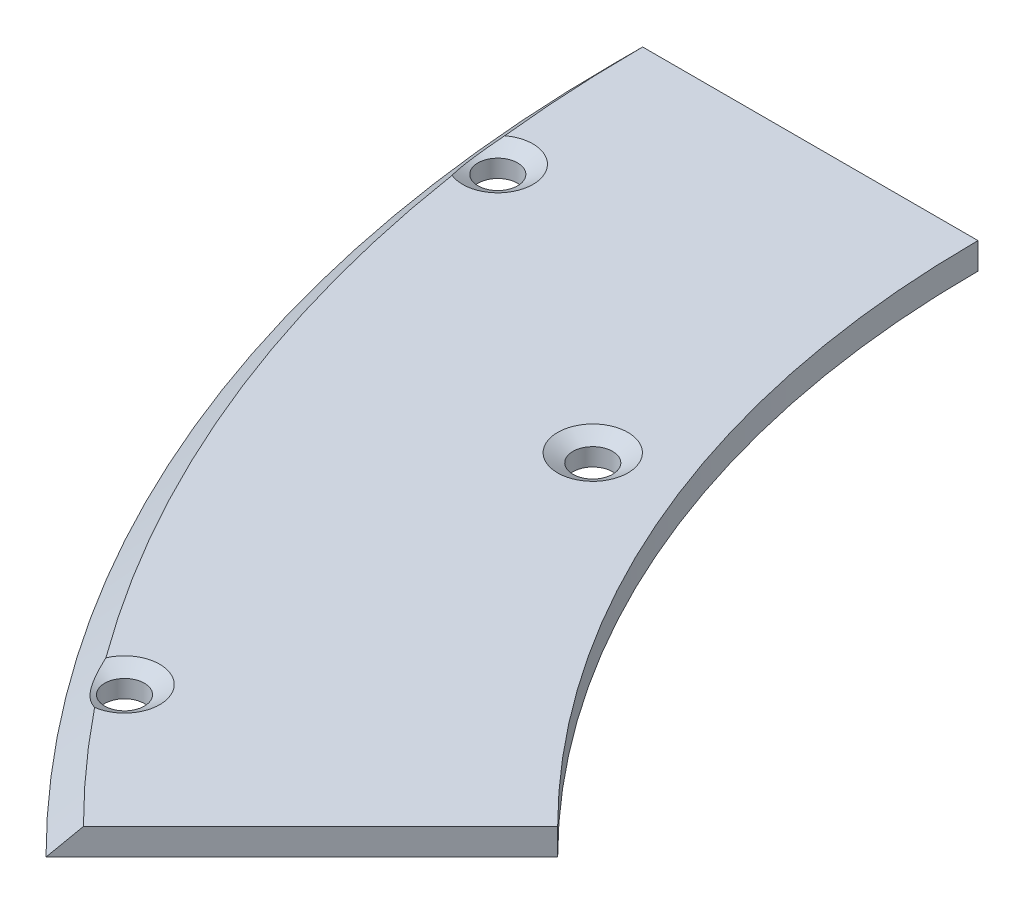
ISO-10303-21;
HEADER;
FILE_DESCRIPTION(('STEP AP214'),'2;1');
FILE_NAME('part.step','',(''),(''),'','','');
FILE_SCHEMA(('AUTOMOTIVE_DESIGN { 1 0 10303 214 1 1 1 1 }'));
ENDSEC;
DATA;
#1=APPLICATION_CONTEXT('core data for automotive mechanical design processes');
#2=APPLICATION_PROTOCOL_DEFINITION('international standard','automotive_design',2000,#1);
#3=PRODUCT_CONTEXT('',#1,'mechanical');
#4=PRODUCT('Part','Part','',(#3));
#5=PRODUCT_RELATED_PRODUCT_CATEGORY('part','',(#4));
#6=PRODUCT_DEFINITION_FORMATION('','',#4);
#7=PRODUCT_DEFINITION_CONTEXT('part definition',#1,'design');
#8=PRODUCT_DEFINITION('design','',#6,#7);
#9=PRODUCT_DEFINITION_SHAPE('','',#8);
#10=(LENGTH_UNIT() NAMED_UNIT(*) SI_UNIT(.MILLI.,.METRE.));
#11=(NAMED_UNIT(*) PLANE_ANGLE_UNIT() SI_UNIT($,.RADIAN.));
#12=(NAMED_UNIT(*) SI_UNIT($,.STERADIAN.) SOLID_ANGLE_UNIT());
#13=UNCERTAINTY_MEASURE_WITH_UNIT(LENGTH_MEASURE(1.E-05),#10,'distance_accuracy_value','');
#14=(GEOMETRIC_REPRESENTATION_CONTEXT(3) GLOBAL_UNCERTAINTY_ASSIGNED_CONTEXT((#13)) GLOBAL_UNIT_ASSIGNED_CONTEXT((#10,
#11,#12)) REPRESENTATION_CONTEXT('',''));
#15=CARTESIAN_POINT('',(0.,0.,0.));
#16=DIRECTION('',(0.,0.,1.));
#17=DIRECTION('',(1.,0.,0.));
#18=AXIS2_PLACEMENT_3D('',#15,#16,#17);
#19=CARTESIAN_POINT('',(0.,3.,0.));
#20=DIRECTION('',(0.,1.,0.));
#21=DIRECTION('',(0.,0.,1.));
#22=AXIS2_PLACEMENT_3D('',#19,#20,#21);
#23=PLANE('',#22);
#24=CARTESIAN_POINT('',(-116.012539426969,3.,42.6420062345319));
#25=DIRECTION('',(0.,1.,0.));
#26=DIRECTION('',(0.,0.,1.));
#27=AXIS2_PLACEMENT_3D('',#24,#25,#26);
#28=CIRCLE('',#27,3.98205080756883);
#29=CARTESIAN_POINT('',(-116.012539426969,3.,46.6240570421007));
#30=VERTEX_POINT('',#29);
#31=EDGE_CURVE('E11',#30,#30,#28,.F.);
#32=ORIENTED_EDGE('',*,*,#31,.T.);
#33=EDGE_LOOP('',(#32));
#34=FACE_BOUND('',#33,.T.);
#35=DIRECTION('',(-1.,0.,0.));
#36=VECTOR('',#35,1.);
#37=CARTESIAN_POINT('',(-115.,3.,0.));
#38=LINE('',#37,#36);
#39=CARTESIAN_POINT('',(-115.,3.,0.));
#40=VERTEX_POINT('',#39);
#41=CARTESIAN_POINT('',(-153.,3.,0.));
#42=VERTEX_POINT('',#41);
#43=EDGE_CURVE('E84',#40,#42,#38,.T.);
#44=ORIENTED_EDGE('',*,*,#43,.T.);
#45=CARTESIAN_POINT('',(0.,3.,0.));
#46=DIRECTION('',(0.,1.,0.));
#47=DIRECTION('',(0.,0.,1.));
#48=AXIS2_PLACEMENT_3D('',#45,#46,#47);
#49=CIRCLE('',#48,153.);
#50=CARTESIAN_POINT('',(-152.10452532569,3.,16.5291674154085));
#51=VERTEX_POINT('',#50);
#52=EDGE_CURVE('E123',#42,#51,#49,.T.);
#53=ORIENTED_EDGE('',*,*,#52,.T.);
#54=CARTESIAN_POINT('',(-149.708174067445,3.,19.7094550252278));
#55=DIRECTION('',(0.,1.,0.));
#56=DIRECTION('',(0.,0.,1.));
#57=AXIS2_PLACEMENT_3D('',#54,#55,#56);
#58=CIRCLE('',#57,3.98205080756889);
#59=CARTESIAN_POINT('',(-151.199752634319,3.,23.4015983069685));
#60=VERTEX_POINT('',#59);
#61=EDGE_CURVE('E108',#51,#60,#58,.F.);
#62=ORIENTED_EDGE('',*,*,#61,.T.);
#63=CARTESIAN_POINT('',(0.,3.,0.));
#64=DIRECTION('',(0.,1.,0.));
#65=DIRECTION('',(0.,0.,1.));
#66=AXIS2_PLACEMENT_3D('',#63,#64,#65);
#67=CIRCLE('',#66,153.);
#68=CARTESIAN_POINT('',(-123.461799254917,3.,90.3669415479939));
#69=VERTEX_POINT('',#68);
#70=EDGE_CURVE('E121',#60,#69,#67,.T.);
#71=ORIENTED_EDGE('',*,*,#70,.T.);
#72=CARTESIAN_POINT('',(-119.796354383977,3.,91.9229757803162));
#73=DIRECTION('',(0.,1.,0.));
#74=DIRECTION('',(0.,0.,1.));
#75=AXIS2_PLACEMENT_3D('',#72,#73,#74);
#76=CIRCLE('',#75,3.98205080756889);
#77=CARTESIAN_POINT('',(-119.24202767376,3.,95.8662549401525));
#78=VERTEX_POINT('',#77);
#79=EDGE_CURVE('E115',#69,#78,#76,.F.);
#80=ORIENTED_EDGE('',*,*,#79,.T.);
#81=CARTESIAN_POINT('',(0.,3.,0.));
#82=DIRECTION('',(0.,1.,0.));
#83=DIRECTION('',(0.,0.,1.));
#84=AXIS2_PLACEMENT_3D('',#81,#82,#83);
#85=CIRCLE('',#84,153.);
#86=CARTESIAN_POINT('',(-108.187337521542,3.00000000000002,108.187337521541));
#87=VERTEX_POINT('',#86);
#88=EDGE_CURVE('E47',#78,#87,#85,.T.);
#89=ORIENTED_EDGE('',*,*,#88,.T.);
#90=DIRECTION('',(0.707106781186551,0.,-0.707106781186544));
#91=VECTOR('',#90,1.);
#92=CARTESIAN_POINT('',(-110.308657865102,3.,110.308657865101));
#93=LINE('',#92,#91);
#94=CARTESIAN_POINT('',(-81.3172798364534,3.,81.3172798364525));
#95=VERTEX_POINT('',#94);
#96=EDGE_CURVE('E92',#87,#95,#93,.T.);
#97=ORIENTED_EDGE('',*,*,#96,.T.);
#98=CARTESIAN_POINT('',(0.,3.,0.));
#99=DIRECTION('',(0.,-1.,0.));
#100=DIRECTION('',(0.,0.,1.));
#101=AXIS2_PLACEMENT_3D('',#98,#99,#100);
#102=CIRCLE('',#101,115.);
#103=EDGE_CURVE('E93',#95,#40,#102,.T.);
#104=ORIENTED_EDGE('',*,*,#103,.T.);
#105=EDGE_LOOP('',(#44,#53,#62,#71,#80,#89,#97,#104));
#106=FACE_BOUND('',#105,.T.);
#107=ADVANCED_FACE('F32',(#34,#106),#23,.T.);
#108=CARTESIAN_POINT('',(0.,0.,0.));
#109=DIRECTION('',(0.,1.,0.));
#110=DIRECTION('',(0.,0.,1.));
#111=AXIS2_PLACEMENT_3D('',#108,#109,#110);
#112=PLANE('',#111);
#113=CARTESIAN_POINT('',(-116.012539426969,0.,42.6420062345319));
#114=DIRECTION('',(0.,1.,0.));
#115=DIRECTION('',(0.,0.,1.));
#116=AXIS2_PLACEMENT_3D('',#113,#114,#115);
#117=CIRCLE('',#116,2.25000000000001);
#118=CARTESIAN_POINT('',(-116.012539426969,0.,44.8920062345319));
#119=VERTEX_POINT('',#118);
#120=EDGE_CURVE('E193',#119,#119,#117,.T.);
#121=ORIENTED_EDGE('',*,*,#120,.T.);
#122=EDGE_LOOP('',(#121));
#123=FACE_BOUND('',#122,.T.);
#124=CARTESIAN_POINT('',(-149.708174067445,0.,19.7094550252278));
#125=DIRECTION('',(0.,1.,0.));
#126=DIRECTION('',(0.,0.,1.));
#127=AXIS2_PLACEMENT_3D('',#124,#125,#126);
#128=CIRCLE('',#127,2.25000000000001);
#129=CARTESIAN_POINT('',(-149.708174067445,0.,21.9594550252278));
#130=VERTEX_POINT('',#129);
#131=EDGE_CURVE('E192',#130,#130,#128,.T.);
#132=ORIENTED_EDGE('',*,*,#131,.T.);
#133=EDGE_LOOP('',(#132));
#134=FACE_BOUND('',#133,.T.);
#135=CARTESIAN_POINT('',(0.,0.,0.));
#136=DIRECTION('',(0.,-1.,0.));
#137=DIRECTION('',(0.,0.,1.));
#138=AXIS2_PLACEMENT_3D('',#135,#136,#137);
#139=CIRCLE('',#138,115.);
#140=CARTESIAN_POINT('',(-81.3172798364534,0.,81.3172798364525));
#141=VERTEX_POINT('',#140);
#142=CARTESIAN_POINT('',(-115.,0.,0.));
#143=VERTEX_POINT('',#142);
#144=EDGE_CURVE('E103',#141,#143,#139,.T.);
#145=ORIENTED_EDGE('',*,*,#144,.F.);
#146=DIRECTION('',(0.707106781186551,0.,-0.707106781186544));
#147=VECTOR('',#146,1.);
#148=CARTESIAN_POINT('',(-110.308657865102,0.,110.308657865101));
#149=LINE('',#148,#147);
#150=CARTESIAN_POINT('',(-110.308657865102,0.,110.308657865101));
#151=VERTEX_POINT('',#150);
#152=EDGE_CURVE('E99',#151,#141,#149,.T.);
#153=ORIENTED_EDGE('',*,*,#152,.F.);
#154=CARTESIAN_POINT('',(0.,0.,0.));
#155=DIRECTION('',(0.,1.,0.));
#156=DIRECTION('',(0.,0.,1.));
#157=AXIS2_PLACEMENT_3D('',#154,#155,#156);
#158=CIRCLE('',#157,156.);
#159=CARTESIAN_POINT('',(-156.,0.,0.));
#160=VERTEX_POINT('',#159);
#161=EDGE_CURVE('E204',#160,#151,#158,.T.);
#162=ORIENTED_EDGE('',*,*,#161,.F.);
#163=DIRECTION('',(-1.,0.,0.));
#164=VECTOR('',#163,1.);
#165=CARTESIAN_POINT('',(-115.,0.,0.));
#166=LINE('',#165,#164);
#167=EDGE_CURVE('E202',#143,#160,#166,.T.);
#168=ORIENTED_EDGE('',*,*,#167,.F.);
#169=EDGE_LOOP('',(#145,#153,#162,#168));
#170=FACE_BOUND('',#169,.T.);
#171=CARTESIAN_POINT('',(-119.796354383977,0.,91.9229757803162));
#172=DIRECTION('',(0.,1.,0.));
#173=DIRECTION('',(0.,0.,1.));
#174=AXIS2_PLACEMENT_3D('',#171,#172,#173);
#175=CIRCLE('',#174,2.25);
#176=CARTESIAN_POINT('',(-119.796354383977,0.,94.1729757803162));
#177=VERTEX_POINT('',#176);
#178=EDGE_CURVE('E190',#177,#177,#175,.T.);
#179=ORIENTED_EDGE('',*,*,#178,.T.);
#180=EDGE_LOOP('',(#179));
#181=FACE_BOUND('',#180,.T.);
#182=ADVANCED_FACE('F153',(#123,#134,#170,#181),#112,.F.);
#183=CARTESIAN_POINT('',(0.,3.,0.));
#184=DIRECTION('',(0.,-1.,0.));
#185=DIRECTION('',(0.,0.,-1.));
#186=AXIS2_PLACEMENT_3D('',#183,#184,#185);
#187=CYLINDRICAL_SURFACE('',#186,115.);
#188=ORIENTED_EDGE('',*,*,#144,.T.);
#189=DIRECTION('',(0.,-1.,0.));
#190=VECTOR('',#189,1.);
#191=CARTESIAN_POINT('',(-115.,3.,0.));
#192=LINE('',#191,#190);
#193=EDGE_CURVE('E88',#40,#143,#192,.T.);
#194=ORIENTED_EDGE('',*,*,#193,.F.);
#195=ORIENTED_EDGE('',*,*,#103,.F.);
#196=DIRECTION('',(0.,-1.,0.));
#197=VECTOR('',#196,1.);
#198=CARTESIAN_POINT('',(-81.3172798364534,3.,81.3172798364525));
#199=LINE('',#198,#197);
#200=EDGE_CURVE('E105',#95,#141,#199,.T.);
#201=ORIENTED_EDGE('',*,*,#200,.T.);
#202=EDGE_LOOP('',(#188,#194,#195,#201));
#203=FACE_BOUND('',#202,.T.);
#204=ADVANCED_FACE('F101',(#203),#187,.F.);
#205=CARTESIAN_POINT('',(-115.,3.,0.));
#206=DIRECTION('',(0.,0.,1.));
#207=DIRECTION('',(1.,0.,0.));
#208=AXIS2_PLACEMENT_3D('',#205,#206,#207);
#209=PLANE('',#208);
#210=ORIENTED_EDGE('',*,*,#167,.T.);
#211=DIRECTION('',(-0.707106781186544,-0.707106781186551,0.));
#212=VECTOR('',#211,1.);
#213=CARTESIAN_POINT('',(0.,156.000000000001,0.));
#214=LINE('',#213,#212);
#215=EDGE_CURVE('E55',#160,#42,#214,.F.);
#216=ORIENTED_EDGE('',*,*,#215,.T.);
#217=ORIENTED_EDGE('',*,*,#43,.F.);
#218=ORIENTED_EDGE('',*,*,#193,.T.);
#219=EDGE_LOOP('',(#210,#216,#217,#218));
#220=FACE_BOUND('',#219,.T.);
#221=ADVANCED_FACE('F86',(#220),#209,.F.);
#222=CARTESIAN_POINT('',(-110.308657865102,3.,110.308657865101));
#223=DIRECTION('',(-0.707106781186544,0.,-0.707106781186551));
#224=DIRECTION('',(-0.707106781186551,0.,0.707106781186544));
#225=AXIS2_PLACEMENT_3D('',#222,#223,#224);
#226=PLANE('',#225);
#227=ORIENTED_EDGE('',*,*,#96,.F.);
#228=DIRECTION('',(0.5,0.707106781186551,-0.499999999999995));
#229=VECTOR('',#228,1.);
#230=CARTESIAN_POINT('',(0.,156.000000000001,0.));
#231=LINE('',#230,#229);
#232=EDGE_CURVE('E208',#87,#151,#231,.F.);
#233=ORIENTED_EDGE('',*,*,#232,.T.);
#234=ORIENTED_EDGE('',*,*,#152,.T.);
#235=ORIENTED_EDGE('',*,*,#200,.F.);
#236=EDGE_LOOP('',(#227,#233,#234,#235));
#237=FACE_BOUND('',#236,.T.);
#238=ADVANCED_FACE('F165',(#237),#226,.F.);
#239=CARTESIAN_POINT('',(-149.708174067445,3.,19.7094550252278));
#240=DIRECTION('',(0.,-1.,0.));
#241=DIRECTION('',(0.,0.,-1.));
#242=AXIS2_PLACEMENT_3D('',#239,#240,#241);
#243=CYLINDRICAL_SURFACE('',#242,2.25000000000001);
#244=CARTESIAN_POINT('',(-149.708174067445,1.99999999999999,19.7094550252278));
#245=DIRECTION('',(0.,1.,0.));
#246=DIRECTION('',(0.,0.,1.));
#247=AXIS2_PLACEMENT_3D('',#244,#245,#246);
#248=CIRCLE('',#247,2.25000000000001);
#249=CARTESIAN_POINT('',(-149.708174067445,1.99999999999999,21.9594550252278));
#250=VERTEX_POINT('',#249);
#251=EDGE_CURVE('E117',#250,#250,#248,.T.);
#252=ORIENTED_EDGE('',*,*,#251,.T.);
#253=EDGE_LOOP('',(#252));
#254=FACE_BOUND('',#253,.T.);
#255=ORIENTED_EDGE('',*,*,#131,.F.);
#256=EDGE_LOOP('',(#255));
#257=FACE_BOUND('',#256,.T.);
#258=ADVANCED_FACE('F162',(#254,#257),#243,.F.);
#259=CARTESIAN_POINT('',(-119.796354383977,3.,91.9229757803162));
#260=DIRECTION('',(0.,-1.,0.));
#261=DIRECTION('',(0.,0.,-1.));
#262=AXIS2_PLACEMENT_3D('',#259,#260,#261);
#263=CYLINDRICAL_SURFACE('',#262,2.25);
#264=CARTESIAN_POINT('',(-119.796354383977,1.99999999999998,91.9229757803162));
#265=DIRECTION('',(0.,1.,0.));
#266=DIRECTION('',(0.,0.,1.));
#267=AXIS2_PLACEMENT_3D('',#264,#265,#266);
#268=CIRCLE('',#267,2.25);
#269=CARTESIAN_POINT('',(-119.796354383977,1.99999999999998,94.1729757803162));
#270=VERTEX_POINT('',#269);
#271=EDGE_CURVE('E104',#270,#270,#268,.T.);
#272=ORIENTED_EDGE('',*,*,#271,.T.);
#273=EDGE_LOOP('',(#272));
#274=FACE_BOUND('',#273,.T.);
#275=ORIENTED_EDGE('',*,*,#178,.F.);
#276=EDGE_LOOP('',(#275));
#277=FACE_BOUND('',#276,.T.);
#278=ADVANCED_FACE('F175',(#274,#277),#263,.F.);
#279=CARTESIAN_POINT('',(-119.796354383977,1.99999999999998,91.9229757803162));
#280=DIRECTION('',(0.,1.,0.));
#281=DIRECTION('',(0.,0.,1.));
#282=AXIS2_PLACEMENT_3D('',#279,#280,#281);
#283=CONICAL_SURFACE('',#282,2.25,1.04719755119659);
#284=ORIENTED_EDGE('',*,*,#79,.F.);
#285=CARTESIAN_POINT('',(-123.461799254917,3.,90.3669415479939));
#286=CARTESIAN_POINT('',(-123.43086619996,2.95799230259586,90.4803258383819));
#287=CARTESIAN_POINT('',(-123.398475590095,2.91703727255009,90.5937200034644));
#288=CARTESIAN_POINT('',(-123.330378336554,2.83759267972244,90.8204451428695));
#289=CARTESIAN_POINT('',(-123.294669961324,2.79910442226574,90.9337760527869));
#290=CARTESIAN_POINT('',(-123.219315966755,2.7247497940451,91.160931933753));
#291=CARTESIAN_POINT('',(-123.179645537626,2.68890274778597,91.27475511774));
#292=CARTESIAN_POINT('',(-123.0961652689,2.62059204780658,91.5018598911807));
#293=CARTESIAN_POINT('',(-123.052356031556,2.58812790326824,91.6151415569203));
#294=CARTESIAN_POINT('',(-122.915354593616,2.4974489120459,91.9505457026514));
#295=CARTESIAN_POINT('',(-122.815492862829,2.44481376842435,92.1716201934287));
#296=CARTESIAN_POINT('',(-122.650347935653,2.38048229355576,92.4979067433283));
#297=CARTESIAN_POINT('',(-122.592815599228,2.36148876983367,92.6056609376342));
#298=CARTESIAN_POINT('',(-122.472396470722,2.32882183957727,92.8189518473314));
#299=CARTESIAN_POINT('',(-122.409510797251,2.31514732491506,92.9244890202638));
#300=CARTESIAN_POINT('',(-122.258309230117,2.29024095731079,93.1644857721));
#301=CARTESIAN_POINT('',(-122.168081534219,2.28102157288939,93.2979642511846));
#302=CARTESIAN_POINT('',(-121.978702147758,2.27287019398707,93.5588191029214));
#303=CARTESIAN_POINT('',(-121.879548020027,2.27394101751394,93.6861937944328));
#304=CARTESIAN_POINT('',(-121.673144789091,2.28631761644576,93.9338488360516));
#305=CARTESIAN_POINT('',(-121.565888957656,2.2976319864059,94.0541231384998));
#306=CARTESIAN_POINT('',(-121.344636221354,2.32987678191294,94.2868578593325));
#307=CARTESIAN_POINT('',(-121.230639938235,2.35080632174493,94.3993189963394));
#308=CARTESIAN_POINT('',(-120.969225238508,2.40732778672588,94.6424512265605));
#309=CARTESIAN_POINT('',(-120.820351906745,2.44523318858431,94.7710145933979));
#310=CARTESIAN_POINT('',(-120.516516131815,2.53204544462214,95.0169396106473));
#311=CARTESIAN_POINT('',(-120.361546886333,2.58096489411536,95.1342882156195));
#312=CARTESIAN_POINT('',(-120.047149647202,2.68771282172956,95.3591833297421));
#313=CARTESIAN_POINT('',(-119.887713007253,2.74555971617013,95.4667088279377));
#314=CARTESIAN_POINT('',(-119.646684890622,2.83746967481599,95.6213345973857));
#315=CARTESIAN_POINT('',(-119.56614860375,2.86891343056184,95.6716976042384));
#316=CARTESIAN_POINT('',(-119.40449955394,2.93334376170601,95.7704268606982));
#317=CARTESIAN_POINT('',(-119.323386933139,2.96632996718199,95.818793583884));
#318=CARTESIAN_POINT('',(-119.24202767376,3.00000000000001,95.8662549401525));
#319=B_SPLINE_CURVE_WITH_KNOTS('',3,(#285,#286,#287,#288,#289,#290,#291,#292,#293,#294,#295,
#296,#297,#298,#299,#300,#301,#302,#303,#304,#305,#306,#307,#308,#309,#310,#311,#312,#313,#314,
#315,#316,#317,#318),.UNSPECIFIED.,.F.,.F.,(4,2,2,2,2,2,2,2,2,2,2,2,2,2,2,2,4),(0.,
0.374438735025378,0.74907400062623,1.1262229191616,1.50331704154201,2.24631772566529,
2.61696943822891,2.98754389020266,3.47098487763635,3.95455826076947,4.43853774872642,
4.92247266316829,5.52255675110642,6.12333059340512,6.72536075252574,7.02550311873682,
7.32557386799686),.UNSPECIFIED.);
#320=EDGE_CURVE('E131',#69,#78,#319,.T.);
#321=ORIENTED_EDGE('',*,*,#320,.T.);
#322=EDGE_LOOP('',(#284,#321));
#323=FACE_BOUND('',#322,.T.);
#324=ORIENTED_EDGE('',*,*,#271,.F.);
#325=EDGE_LOOP('',(#324));
#326=FACE_BOUND('',#325,.T.);
#327=ADVANCED_FACE('F172',(#323,#326),#283,.F.);
#328=CARTESIAN_POINT('',(-149.708174067445,1.99999999999999,19.7094550252278));
#329=DIRECTION('',(0.,1.,0.));
#330=DIRECTION('',(0.,0.,1.));
#331=AXIS2_PLACEMENT_3D('',#328,#329,#330);
#332=CONICAL_SURFACE('',#331,2.25000000000001,1.04719755119659);
#333=ORIENTED_EDGE('',*,*,#61,.F.);
#334=CARTESIAN_POINT('',(-152.10452532569,3.,16.5291674154085));
#335=CARTESIAN_POINT('',(-152.134428659474,2.95799230259587,16.642827618753));
#336=CARTESIAN_POINT('',(-152.163074651029,2.9170372725501,16.7572251512879));
#337=CARTESIAN_POINT('',(-152.217463269237,2.83759267972244,16.9876235084599));
#338=CARTESIAN_POINT('',(-152.243204364118,2.79910442226575,17.1036251430974));
#339=CARTESIAN_POINT('',(-152.291523831027,2.7247497940451,17.3380249039178));
#340=CARTESIAN_POINT('',(-152.314079823617,2.68890274778597,17.4564338873543));
#341=CARTESIAN_POINT('',(-152.355336176905,2.62059204780659,17.694852524838));
#342=CARTESIAN_POINT('',(-152.374037097314,2.58812790326825,17.8148619438234));
#343=CARTESIAN_POINT('',(-152.42309244457,2.49744891204591,18.1738311735309));
#344=CARTESIAN_POINT('',(-152.44714689423,2.44481376842435,18.4152181640665));
#345=CARTESIAN_POINT('',(-152.467270466939,2.38048229355576,18.7803630687808));
#346=CARTESIAN_POINT('',(-152.471323099209,2.36148876983367,18.9024471066265));
#347=CARTESIAN_POINT('',(-152.47368252967,2.32882183957728,19.1473720170734));
#348=CARTESIAN_POINT('',(-152.471990525377,2.31514732491507,19.2702127266117));
#349=CARTESIAN_POINT('',(-152.461044503065,2.2902409573108,19.553656794095));
#350=CARTESIAN_POINT('',(-152.449644265834,2.2810215728894,19.7143663957898));
#351=CARTESIAN_POINT('',(-152.416064332075,2.27287019398708,20.0349630173245));
#352=CARTESIAN_POINT('',(-152.393881684325,2.27394101751394,20.194849799838));
#353=CARTESIAN_POINT('',(-152.33895876372,2.28631761644576,20.5125269727236));
#354=CARTESIAN_POINT('',(-152.306209640218,2.29763198640591,20.6703154897836));
#355=CARTESIAN_POINT('',(-152.23096651034,2.32987678191295,20.9824960385184));
#356=CARTESIAN_POINT('',(-152.188473401726,2.35080632174494,21.136888381664));
#357=CARTESIAN_POINT('',(-152.083647745949,2.40732778672588,21.4781544193782));
#358=CARTESIAN_POINT('',(-152.019001342116,2.4452331885843,21.6639302269364));
#359=CARTESIAN_POINT('',(-151.878834351073,2.53204544462213,22.0288254267656));
#360=CARTESIAN_POINT('',(-151.803301350166,2.58096489411536,22.2079369225115));
#361=CARTESIAN_POINT('',(-151.64347291126,2.68771282172957,22.5599004240943));
#362=CARTESIAN_POINT('',(-151.559159479868,2.74555971617012,22.7327385570603));
#363=CARTESIAN_POINT('',(-151.427735892563,2.83746967481598,22.9871624597977));
#364=CARTESIAN_POINT('',(-151.383170925632,2.86891343056183,23.0710462465791));
#365=CARTESIAN_POINT('',(-151.292543370228,2.933343761706,23.2373728156753));
#366=CARTESIAN_POINT('',(-151.246481141641,2.96632996718198,23.3198159370521));
#367=CARTESIAN_POINT('',(-151.199752634319,2.99999999999999,23.4015983069685));
#368=B_SPLINE_CURVE_WITH_KNOTS('',3,(#334,#335,#336,#337,#338,#339,#340,#341,#342,#343,#344,
#345,#346,#347,#348,#349,#350,#351,#352,#353,#354,#355,#356,#357,#358,#359,#360,#361,#362,#363,
#364,#365,#366,#367),.UNSPECIFIED.,.F.,.F.,(4,2,2,2,2,2,2,2,2,2,2,2,2,2,2,2,4),(0.,
0.374438735025374,0.749074000626217,1.12622291916156,1.50331704154197,2.24631772566528,
2.61696943822888,2.98754389020262,3.47098487763631,3.95455826076944,4.43853774872638,
4.92247266316825,5.52255675110634,6.12333059340507,6.7253607525257,7.02550311873677,
7.32557386799681),.UNSPECIFIED.);
#369=EDGE_CURVE('E125',#51,#60,#368,.T.);
#370=ORIENTED_EDGE('',*,*,#369,.T.);
#371=EDGE_LOOP('',(#333,#370));
#372=FACE_BOUND('',#371,.T.);
#373=ORIENTED_EDGE('',*,*,#251,.F.);
#374=EDGE_LOOP('',(#373));
#375=FACE_BOUND('',#374,.T.);
#376=ADVANCED_FACE('F137',(#372,#375),#332,.F.);
#377=CARTESIAN_POINT('',(-116.012539426969,0.,42.6420062345319));
#378=DIRECTION('',(0.,1.,0.));
#379=DIRECTION('',(0.,0.,1.));
#380=AXIS2_PLACEMENT_3D('',#377,#378,#379);
#381=CYLINDRICAL_SURFACE('',#380,2.25000000000001);
#382=CARTESIAN_POINT('',(-116.012539426969,2.00000000000003,42.6420062345319));
#383=DIRECTION('',(0.,1.,0.));
#384=DIRECTION('',(0.,0.,1.));
#385=AXIS2_PLACEMENT_3D('',#382,#383,#384);
#386=CIRCLE('',#385,2.25000000000001);
#387=CARTESIAN_POINT('',(-116.012539426969,2.00000000000003,44.8920062345319));
#388=VERTEX_POINT('',#387);
#389=EDGE_CURVE('E40',#388,#388,#386,.T.);
#390=ORIENTED_EDGE('',*,*,#389,.T.);
#391=EDGE_LOOP('',(#390));
#392=FACE_BOUND('',#391,.T.);
#393=ORIENTED_EDGE('',*,*,#120,.F.);
#394=EDGE_LOOP('',(#393));
#395=FACE_BOUND('',#394,.T.);
#396=ADVANCED_FACE('F142',(#392,#395),#381,.F.);
#397=CARTESIAN_POINT('',(0.,3.,0.));
#398=DIRECTION('',(0.,-1.,0.));
#399=DIRECTION('',(0.,0.,-1.));
#400=AXIS2_PLACEMENT_3D('',#397,#398,#399);
#401=CONICAL_SURFACE('',#400,153.,0.785398163397444);
#402=ORIENTED_EDGE('',*,*,#215,.F.);
#403=ORIENTED_EDGE('',*,*,#161,.T.);
#404=ORIENTED_EDGE('',*,*,#232,.F.);
#405=ORIENTED_EDGE('',*,*,#88,.F.);
#406=ORIENTED_EDGE('',*,*,#320,.F.);
#407=ORIENTED_EDGE('',*,*,#70,.F.);
#408=ORIENTED_EDGE('',*,*,#369,.F.);
#409=ORIENTED_EDGE('',*,*,#52,.F.);
#410=EDGE_LOOP('',(#402,#403,#404,#405,#406,#407,#408,#409));
#411=FACE_BOUND('',#410,.T.);
#412=ADVANCED_FACE('F139',(#411),#401,.T.);
#413=CARTESIAN_POINT('',(-116.012539426969,2.00000000000003,42.6420062345319));
#414=DIRECTION('',(0.,1.,0.));
#415=DIRECTION('',(0.,0.,1.));
#416=AXIS2_PLACEMENT_3D('',#413,#414,#415);
#417=CONICAL_SURFACE('',#416,2.25000000000001,1.0471975511966);
#418=ORIENTED_EDGE('',*,*,#31,.F.);
#419=EDGE_LOOP('',(#418));
#420=FACE_BOUND('',#419,.T.);
#421=ORIENTED_EDGE('',*,*,#389,.F.);
#422=EDGE_LOOP('',(#421));
#423=FACE_BOUND('',#422,.T.);
#424=ADVANCED_FACE('F34',(#420,#423),#417,.F.);
#425=CLOSED_SHELL('',(#107,#182,#204,#221,#238,#258,#278,#327,#376,#396,#412,#424));
#426=MANIFOLD_SOLID_BREP('B2',#425);
#427=ADVANCED_BREP_SHAPE_REPRESENTATION('',(#18,#426),#14);
#428=SHAPE_DEFINITION_REPRESENTATION(#9,#427);
ENDSEC;
END-ISO-10303-21;
